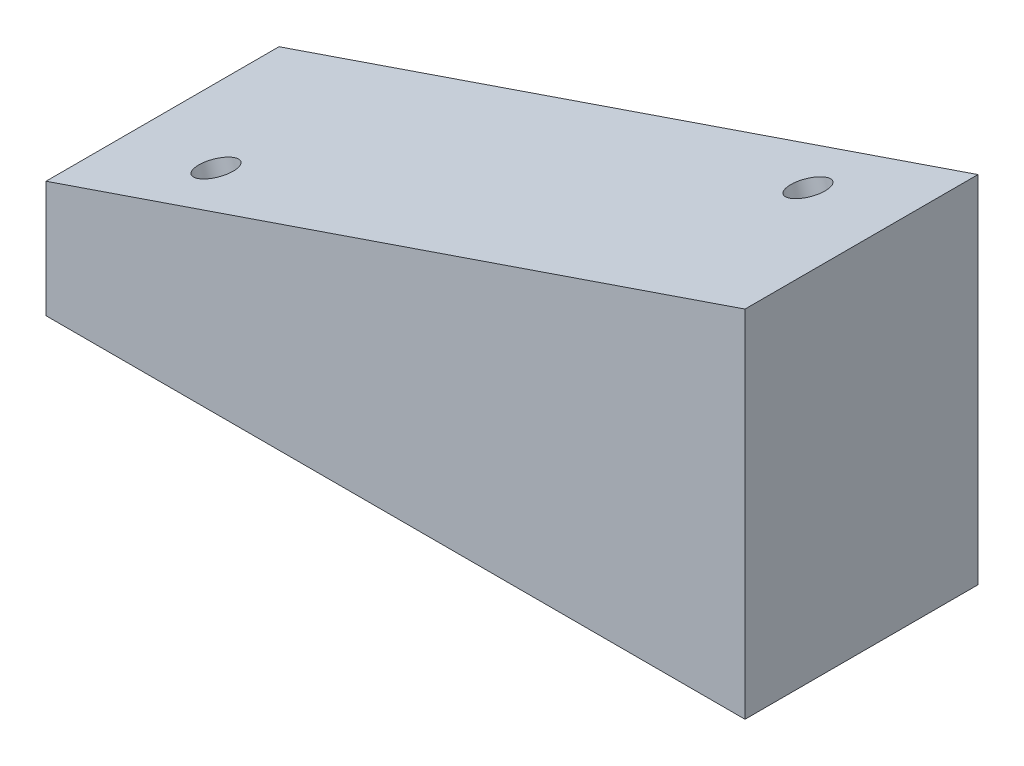
ISO-10303-21;
HEADER;
FILE_DESCRIPTION(('STEP AP214'),'2;1');
FILE_NAME('part.step','',(''),(''),'','','');
FILE_SCHEMA(('AUTOMOTIVE_DESIGN { 1 0 10303 214 1 1 1 1 }'));
ENDSEC;
DATA;
#1=APPLICATION_CONTEXT('core data for automotive mechanical design processes');
#2=APPLICATION_PROTOCOL_DEFINITION('international standard','automotive_design',2000,#1);
#3=PRODUCT_CONTEXT('',#1,'mechanical');
#4=PRODUCT('Part','Part','',(#3));
#5=PRODUCT_RELATED_PRODUCT_CATEGORY('part','',(#4));
#6=PRODUCT_DEFINITION_FORMATION('','',#4);
#7=PRODUCT_DEFINITION_CONTEXT('part definition',#1,'design');
#8=PRODUCT_DEFINITION('design','',#6,#7);
#9=PRODUCT_DEFINITION_SHAPE('','',#8);
#10=(LENGTH_UNIT() NAMED_UNIT(*) SI_UNIT(.MILLI.,.METRE.));
#11=(NAMED_UNIT(*) PLANE_ANGLE_UNIT() SI_UNIT($,.RADIAN.));
#12=(NAMED_UNIT(*) SI_UNIT($,.STERADIAN.) SOLID_ANGLE_UNIT());
#13=UNCERTAINTY_MEASURE_WITH_UNIT(LENGTH_MEASURE(1.E-05),#10,'distance_accuracy_value','');
#14=(GEOMETRIC_REPRESENTATION_CONTEXT(3) GLOBAL_UNCERTAINTY_ASSIGNED_CONTEXT((#13)) GLOBAL_UNIT_ASSIGNED_CONTEXT((#10,
#11,#12)) REPRESENTATION_CONTEXT('',''));
#15=CARTESIAN_POINT('',(0.,0.,0.));
#16=DIRECTION('',(0.,0.,1.));
#17=DIRECTION('',(1.,0.,0.));
#18=AXIS2_PLACEMENT_3D('',#15,#16,#17);
#19=CARTESIAN_POINT('',(-76.2,25.4,-50.8));
#20=DIRECTION('',(-1.,0.,0.));
#21=DIRECTION('',(0.,0.,1.));
#22=AXIS2_PLACEMENT_3D('',#19,#20,#21);
#23=PLANE('',#22);
#24=DIRECTION('',(0.,-1.,0.));
#25=VECTOR('',#24,1.);
#26=CARTESIAN_POINT('',(-76.2,25.4,0.));
#27=LINE('',#26,#25);
#28=CARTESIAN_POINT('',(-76.2,25.4,0.));
#29=VERTEX_POINT('',#28);
#30=CARTESIAN_POINT('',(-76.2,0.,0.));
#31=VERTEX_POINT('',#30);
#32=EDGE_CURVE('E127',#29,#31,#27,.T.);
#33=ORIENTED_EDGE('',*,*,#32,.F.);
#34=DIRECTION('',(0.,0.,1.));
#35=VECTOR('',#34,1.);
#36=CARTESIAN_POINT('',(-76.2,25.4,-50.8));
#37=LINE('',#36,#35);
#38=CARTESIAN_POINT('',(-76.2,25.4,-50.8));
#39=VERTEX_POINT('',#38);
#40=EDGE_CURVE('E11',#39,#29,#37,.T.);
#41=ORIENTED_EDGE('',*,*,#40,.F.);
#42=DIRECTION('',(0.,-1.,0.));
#43=VECTOR('',#42,1.);
#44=CARTESIAN_POINT('',(-76.2,25.4,-50.8));
#45=LINE('',#44,#43);
#46=CARTESIAN_POINT('',(-76.2,0.,-50.8));
#47=VERTEX_POINT('',#46);
#48=EDGE_CURVE('E128',#39,#47,#45,.T.);
#49=ORIENTED_EDGE('',*,*,#48,.T.);
#50=DIRECTION('',(0.,0.,1.));
#51=VECTOR('',#50,1.);
#52=CARTESIAN_POINT('',(-76.2,0.,-50.8));
#53=LINE('',#52,#51);
#54=EDGE_CURVE('E39',#47,#31,#53,.T.);
#55=ORIENTED_EDGE('',*,*,#54,.T.);
#56=EDGE_LOOP('',(#33,#41,#49,#55));
#57=FACE_BOUND('',#56,.T.);
#58=ADVANCED_FACE('F36',(#57),#23,.T.);
#59=CARTESIAN_POINT('',(76.2,77.4593438028308,-50.8));
#60=DIRECTION('',(-0.323256847134431,0.946311265272007,0.));
#61=DIRECTION('',(-0.946311265272007,-0.323256847134431,0.));
#62=AXIS2_PLACEMENT_3D('',#59,#60,#61);
#63=PLANE('',#62);
#64=CARTESIAN_POINT('',(-51.8282851098662,33.7252984549215,-12.7));
#65=DIRECTION('',(-0.323256847134431,0.946311265272007,0.));
#66=DIRECTION('',(-0.946311265272007,-0.323256847134431,0.));
#67=AXIS2_PLACEMENT_3D('',#64,#65,#66);
#68=CIRCLE('',#67,3.96874999999999);
#69=CARTESIAN_POINT('',(-55.5839579439145,32.4423728428568,-12.7));
#70=VERTEX_POINT('',#69);
#71=EDGE_CURVE('E115',#70,#70,#68,.T.);
#72=ORIENTED_EDGE('',*,*,#71,.F.);
#73=EDGE_LOOP('',(#72));
#74=FACE_BOUND('',#73,.T.);
#75=CARTESIAN_POINT('',(51.8282851098663,69.1340453479093,-38.1));
#76=DIRECTION('',(-0.323256847134431,0.946311265272007,0.));
#77=DIRECTION('',(-0.946311265272007,-0.323256847134431,0.));
#78=AXIS2_PLACEMENT_3D('',#75,#76,#77);
#79=CIRCLE('',#78,3.96874999999999);
#80=CARTESIAN_POINT('',(48.072612275818,67.8511197358445,-38.1));
#81=VERTEX_POINT('',#80);
#82=EDGE_CURVE('E121',#81,#81,#79,.T.);
#83=ORIENTED_EDGE('',*,*,#82,.F.);
#84=EDGE_LOOP('',(#83));
#85=FACE_BOUND('',#84,.T.);
#86=DIRECTION('',(-0.946311265272007,-0.323256847134431,0.));
#87=VECTOR('',#86,1.);
#88=CARTESIAN_POINT('',(76.2,77.4593438028308,0.));
#89=LINE('',#88,#87);
#90=CARTESIAN_POINT('',(76.2,77.4593438028308,0.));
#91=VERTEX_POINT('',#90);
#92=EDGE_CURVE('E131',#91,#29,#89,.T.);
#93=ORIENTED_EDGE('',*,*,#92,.F.);
#94=DIRECTION('',(0.,0.,1.));
#95=VECTOR('',#94,1.);
#96=CARTESIAN_POINT('',(76.2,77.4593438028308,-50.8));
#97=LINE('',#96,#95);
#98=CARTESIAN_POINT('',(76.2,77.4593438028308,-50.8));
#99=VERTEX_POINT('',#98);
#100=EDGE_CURVE('E45',#99,#91,#97,.T.);
#101=ORIENTED_EDGE('',*,*,#100,.F.);
#102=DIRECTION('',(-0.946311265272007,-0.323256847134431,0.));
#103=VECTOR('',#102,1.);
#104=CARTESIAN_POINT('',(76.2,77.4593438028308,-50.8));
#105=LINE('',#104,#103);
#106=EDGE_CURVE('E135',#99,#39,#105,.T.);
#107=ORIENTED_EDGE('',*,*,#106,.T.);
#108=ORIENTED_EDGE('',*,*,#40,.T.);
#109=EDGE_LOOP('',(#93,#101,#107,#108));
#110=FACE_BOUND('',#109,.T.);
#111=ADVANCED_FACE('F150',(#74,#85,#110),#63,.T.);
#112=CARTESIAN_POINT('',(76.2,0.,-50.8));
#113=DIRECTION('',(1.,0.,0.));
#114=DIRECTION('',(0.,0.,-1.));
#115=AXIS2_PLACEMENT_3D('',#112,#113,#114);
#116=PLANE('',#115);
#117=DIRECTION('',(0.,1.,0.));
#118=VECTOR('',#117,1.);
#119=CARTESIAN_POINT('',(76.2,0.,0.));
#120=LINE('',#119,#118);
#121=CARTESIAN_POINT('',(76.2,0.,0.));
#122=VERTEX_POINT('',#121);
#123=EDGE_CURVE('E142',#122,#91,#120,.T.);
#124=ORIENTED_EDGE('',*,*,#123,.F.);
#125=DIRECTION('',(0.,0.,1.));
#126=VECTOR('',#125,1.);
#127=CARTESIAN_POINT('',(76.2,0.,-50.8));
#128=LINE('',#127,#126);
#129=CARTESIAN_POINT('',(76.2,0.,-50.8));
#130=VERTEX_POINT('',#129);
#131=EDGE_CURVE('E146',#130,#122,#128,.T.);
#132=ORIENTED_EDGE('',*,*,#131,.F.);
#133=DIRECTION('',(0.,1.,0.));
#134=VECTOR('',#133,1.);
#135=CARTESIAN_POINT('',(76.2,0.,-50.8));
#136=LINE('',#135,#134);
#137=EDGE_CURVE('E133',#130,#99,#136,.T.);
#138=ORIENTED_EDGE('',*,*,#137,.T.);
#139=ORIENTED_EDGE('',*,*,#100,.T.);
#140=EDGE_LOOP('',(#124,#132,#138,#139));
#141=FACE_BOUND('',#140,.T.);
#142=ADVANCED_FACE('F153',(#141),#116,.T.);
#143=CARTESIAN_POINT('',(-76.2,0.,-50.8));
#144=DIRECTION('',(0.,-1.,0.));
#145=DIRECTION('',(1.,0.,0.));
#146=AXIS2_PLACEMENT_3D('',#143,#144,#145);
#147=PLANE('',#146);
#148=CARTESIAN_POINT('',(-38.1,0.,-25.4));
#149=DIRECTION('',(0.,-1.,0.));
#150=DIRECTION('',(0.,0.,-1.));
#151=AXIS2_PLACEMENT_3D('',#148,#149,#150);
#152=CIRCLE('',#151,3.96874999999999);
#153=CARTESIAN_POINT('',(-38.1,0.,-29.36875));
#154=VERTEX_POINT('',#153);
#155=EDGE_CURVE('E105',#154,#154,#152,.T.);
#156=ORIENTED_EDGE('',*,*,#155,.F.);
#157=EDGE_LOOP('',(#156));
#158=FACE_BOUND('',#157,.T.);
#159=CARTESIAN_POINT('',(38.1,0.,-25.4));
#160=DIRECTION('',(0.,-1.,0.));
#161=DIRECTION('',(0.,0.,-1.));
#162=AXIS2_PLACEMENT_3D('',#159,#160,#161);
#163=CIRCLE('',#162,3.96874999999999);
#164=CARTESIAN_POINT('',(38.1,0.,-29.36875));
#165=VERTEX_POINT('',#164);
#166=EDGE_CURVE('E104',#165,#165,#163,.T.);
#167=ORIENTED_EDGE('',*,*,#166,.F.);
#168=EDGE_LOOP('',(#167));
#169=FACE_BOUND('',#168,.T.);
#170=DIRECTION('',(1.,0.,0.));
#171=VECTOR('',#170,1.);
#172=CARTESIAN_POINT('',(-76.2,0.,0.));
#173=LINE('',#172,#171);
#174=EDGE_CURVE('E139',#31,#122,#173,.T.);
#175=ORIENTED_EDGE('',*,*,#174,.F.);
#176=ORIENTED_EDGE('',*,*,#54,.F.);
#177=DIRECTION('',(1.,0.,0.));
#178=VECTOR('',#177,1.);
#179=CARTESIAN_POINT('',(-76.2,0.,-50.8));
#180=LINE('',#179,#178);
#181=EDGE_CURVE('E130',#47,#130,#180,.T.);
#182=ORIENTED_EDGE('',*,*,#181,.T.);
#183=ORIENTED_EDGE('',*,*,#131,.T.);
#184=EDGE_LOOP('',(#175,#176,#182,#183));
#185=FACE_BOUND('',#184,.T.);
#186=ADVANCED_FACE('F147',(#158,#169,#185),#147,.T.);
#187=CARTESIAN_POINT('',(0.,0.,-50.8));
#188=DIRECTION('',(0.,0.,1.));
#189=DIRECTION('',(1.,0.,0.));
#190=AXIS2_PLACEMENT_3D('',#187,#188,#189);
#191=PLANE('',#190);
#192=ORIENTED_EDGE('',*,*,#48,.F.);
#193=ORIENTED_EDGE('',*,*,#106,.F.);
#194=ORIENTED_EDGE('',*,*,#137,.F.);
#195=ORIENTED_EDGE('',*,*,#181,.F.);
#196=EDGE_LOOP('',(#192,#193,#194,#195));
#197=FACE_BOUND('',#196,.T.);
#198=ADVANCED_FACE('F155',(#197),#191,.F.);
#199=CARTESIAN_POINT('',(0.,0.,0.));
#200=DIRECTION('',(0.,0.,1.));
#201=DIRECTION('',(1.,0.,0.));
#202=AXIS2_PLACEMENT_3D('',#199,#200,#201);
#203=PLANE('',#202);
#204=ORIENTED_EDGE('',*,*,#32,.T.);
#205=ORIENTED_EDGE('',*,*,#174,.T.);
#206=ORIENTED_EDGE('',*,*,#123,.T.);
#207=ORIENTED_EDGE('',*,*,#92,.T.);
#208=EDGE_LOOP('',(#204,#205,#206,#207));
#209=FACE_BOUND('',#208,.T.);
#210=ADVANCED_FACE('F149',(#209),#203,.T.);
#211=CARTESIAN_POINT('',(60.0390090270808,45.0977392100003,-38.1));
#212=DIRECTION('',(-0.323256847134431,0.946311265272007,0.));
#213=DIRECTION('',(-0.946311265272007,-0.323256847134431,0.));
#214=AXIS2_PLACEMENT_3D('',#211,#212,#213);
#215=CONICAL_SURFACE('',#214,3.96874999999999,1.02974425867665);
#216=CARTESIAN_POINT('',(60.8098685045124,42.841103306069,-38.1));
#217=VERTEX_POINT('',#216);
#218=VERTEX_LOOP('',#217);
#219=FACE_BOUND('',#218,.T.);
#220=CARTESIAN_POINT('',(60.0390090270808,45.0977392100003,-38.1));
#221=DIRECTION('',(-0.323256847134431,0.946311265272007,0.));
#222=DIRECTION('',(-0.946311265272007,-0.323256847134431,0.));
#223=AXIS2_PLACEMENT_3D('',#220,#221,#222);
#224=CIRCLE('',#223,3.96874999999999);
#225=CARTESIAN_POINT('',(56.2833361930325,43.8148135979355,-38.1));
#226=VERTEX_POINT('',#225);
#227=EDGE_CURVE('E124',#226,#226,#224,.T.);
#228=ORIENTED_EDGE('',*,*,#227,.T.);
#229=EDGE_LOOP('',(#228));
#230=FACE_BOUND('',#229,.T.);
#231=ADVANCED_FACE('F162',(#219,#230),#215,.F.);
#232=CARTESIAN_POINT('',(51.8282851098663,69.1340453479093,-38.1));
#233=DIRECTION('',(-0.323256847134431,0.946311265272007,0.));
#234=DIRECTION('',(-0.946311265272007,-0.323256847134431,0.));
#235=AXIS2_PLACEMENT_3D('',#232,#233,#234);
#236=CYLINDRICAL_SURFACE('',#235,3.96874999999999);
#237=ORIENTED_EDGE('',*,*,#227,.F.);
#238=EDGE_LOOP('',(#237));
#239=FACE_BOUND('',#238,.T.);
#240=ORIENTED_EDGE('',*,*,#82,.T.);
#241=EDGE_LOOP('',(#240));
#242=FACE_BOUND('',#241,.T.);
#243=ADVANCED_FACE('F180',(#239,#242),#236,.F.);
#244=CARTESIAN_POINT('',(-43.6175611926517,9.68899231701257,-12.7));
#245=DIRECTION('',(-0.323256847134431,0.946311265272007,0.));
#246=DIRECTION('',(-0.946311265272007,-0.323256847134431,0.));
#247=AXIS2_PLACEMENT_3D('',#244,#245,#246);
#248=CONICAL_SURFACE('',#247,3.96874999999999,1.02974425867665);
#249=CARTESIAN_POINT('',(-42.8467017152201,7.43235641308133,-12.7));
#250=VERTEX_POINT('',#249);
#251=VERTEX_LOOP('',#250);
#252=FACE_BOUND('',#251,.T.);
#253=CARTESIAN_POINT('',(-43.6175611926517,9.68899231701257,-12.7));
#254=DIRECTION('',(-0.323256847134431,0.946311265272007,0.));
#255=DIRECTION('',(-0.946311265272007,-0.323256847134431,0.));
#256=AXIS2_PLACEMENT_3D('',#253,#254,#255);
#257=CIRCLE('',#256,3.96874999999999);
#258=CARTESIAN_POINT('',(-47.3732340267,8.4060667049478,-12.7));
#259=VERTEX_POINT('',#258);
#260=EDGE_CURVE('E118',#259,#259,#257,.T.);
#261=ORIENTED_EDGE('',*,*,#260,.T.);
#262=EDGE_LOOP('',(#261));
#263=FACE_BOUND('',#262,.T.);
#264=ADVANCED_FACE('F182',(#252,#263),#248,.F.);
#265=CARTESIAN_POINT('',(-51.8282851098662,33.7252984549215,-12.7));
#266=DIRECTION('',(-0.323256847134431,0.946311265272007,0.));
#267=DIRECTION('',(-0.946311265272007,-0.323256847134431,0.));
#268=AXIS2_PLACEMENT_3D('',#265,#266,#267);
#269=CYLINDRICAL_SURFACE('',#268,3.96874999999999);
#270=ORIENTED_EDGE('',*,*,#260,.F.);
#271=EDGE_LOOP('',(#270));
#272=FACE_BOUND('',#271,.T.);
#273=ORIENTED_EDGE('',*,*,#71,.T.);
#274=EDGE_LOOP('',(#273));
#275=FACE_BOUND('',#274,.T.);
#276=ADVANCED_FACE('F189',(#272,#275),#269,.F.);
#277=CARTESIAN_POINT('',(38.1,25.4,-25.4));
#278=DIRECTION('',(0.,-1.,0.));
#279=DIRECTION('',(0.,0.,-1.));
#280=AXIS2_PLACEMENT_3D('',#277,#278,#279);
#281=CONICAL_SURFACE('',#280,3.96874999999999,1.02974425867665);
#282=CARTESIAN_POINT('',(38.1,27.7846655817656,-25.4));
#283=VERTEX_POINT('',#282);
#284=VERTEX_LOOP('',#283);
#285=FACE_BOUND('',#284,.T.);
#286=CARTESIAN_POINT('',(38.1,25.4,-25.4));
#287=DIRECTION('',(0.,-1.,0.));
#288=DIRECTION('',(0.,0.,-1.));
#289=AXIS2_PLACEMENT_3D('',#286,#287,#288);
#290=CIRCLE('',#289,3.96874999999999);
#291=CARTESIAN_POINT('',(38.1,25.4,-29.36875));
#292=VERTEX_POINT('',#291);
#293=EDGE_CURVE('E108',#292,#292,#290,.T.);
#294=ORIENTED_EDGE('',*,*,#293,.T.);
#295=EDGE_LOOP('',(#294));
#296=FACE_BOUND('',#295,.T.);
#297=ADVANCED_FACE('F197',(#285,#296),#281,.F.);
#298=CARTESIAN_POINT('',(38.1,0.,-25.4));
#299=DIRECTION('',(0.,-1.,0.));
#300=DIRECTION('',(0.,0.,-1.));
#301=AXIS2_PLACEMENT_3D('',#298,#299,#300);
#302=CYLINDRICAL_SURFACE('',#301,3.96874999999999);
#303=ORIENTED_EDGE('',*,*,#293,.F.);
#304=EDGE_LOOP('',(#303));
#305=FACE_BOUND('',#304,.T.);
#306=ORIENTED_EDGE('',*,*,#166,.T.);
#307=EDGE_LOOP('',(#306));
#308=FACE_BOUND('',#307,.T.);
#309=ADVANCED_FACE('F98',(#305,#308),#302,.F.);
#310=CARTESIAN_POINT('',(-38.1,25.4,-25.4));
#311=DIRECTION('',(0.,-1.,0.));
#312=DIRECTION('',(0.,0.,-1.));
#313=AXIS2_PLACEMENT_3D('',#310,#311,#312);
#314=CONICAL_SURFACE('',#313,3.96874999999999,1.02974425867665);
#315=CARTESIAN_POINT('',(-38.1,27.7846655817656,-25.4));
#316=VERTEX_POINT('',#315);
#317=VERTEX_LOOP('',#316);
#318=FACE_BOUND('',#317,.T.);
#319=CARTESIAN_POINT('',(-38.1,25.4,-25.4));
#320=DIRECTION('',(0.,-1.,0.));
#321=DIRECTION('',(0.,0.,-1.));
#322=AXIS2_PLACEMENT_3D('',#319,#320,#321);
#323=CIRCLE('',#322,3.96874999999999);
#324=CARTESIAN_POINT('',(-38.1,25.4,-29.36875));
#325=VERTEX_POINT('',#324);
#326=EDGE_CURVE('E102',#325,#325,#323,.T.);
#327=ORIENTED_EDGE('',*,*,#326,.T.);
#328=EDGE_LOOP('',(#327));
#329=FACE_BOUND('',#328,.T.);
#330=ADVANCED_FACE('F94',(#318,#329),#314,.F.);
#331=CARTESIAN_POINT('',(-38.1,0.,-25.4));
#332=DIRECTION('',(0.,-1.,0.));
#333=DIRECTION('',(0.,0.,-1.));
#334=AXIS2_PLACEMENT_3D('',#331,#332,#333);
#335=CYLINDRICAL_SURFACE('',#334,3.96874999999999);
#336=ORIENTED_EDGE('',*,*,#326,.F.);
#337=EDGE_LOOP('',(#336));
#338=FACE_BOUND('',#337,.T.);
#339=ORIENTED_EDGE('',*,*,#155,.T.);
#340=EDGE_LOOP('',(#339));
#341=FACE_BOUND('',#340,.T.);
#342=ADVANCED_FACE('F97',(#338,#341),#335,.F.);
#343=CLOSED_SHELL('',(#58,#111,#142,#186,#198,#210,#231,#243,#264,#276,#297,#309,#330,#342));
#344=MANIFOLD_SOLID_BREP('B2',#343);
#345=ADVANCED_BREP_SHAPE_REPRESENTATION('',(#18,#344),#14);
#346=SHAPE_DEFINITION_REPRESENTATION(#9,#345);
ENDSEC;
END-ISO-10303-21;
